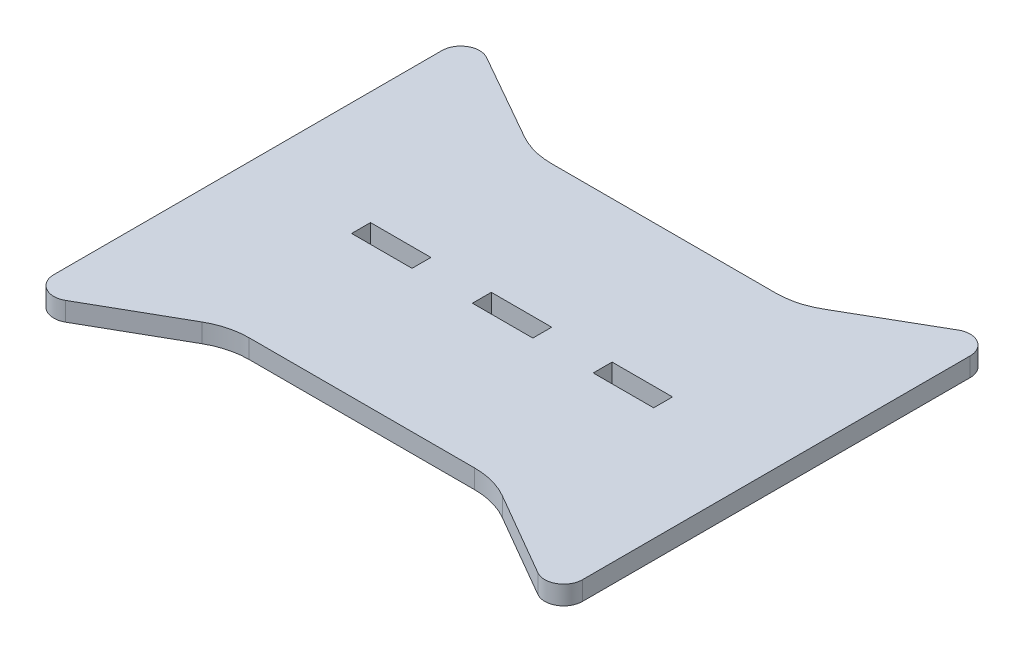
ISO-10303-21;
HEADER;
FILE_DESCRIPTION(('STEP AP214'),'2;1');
FILE_NAME('part.step','',(''),(''),'','','');
FILE_SCHEMA(('AUTOMOTIVE_DESIGN { 1 0 10303 214 1 1 1 1 }'));
ENDSEC;
DATA;
#1=APPLICATION_CONTEXT('core data for automotive mechanical design processes');
#2=APPLICATION_PROTOCOL_DEFINITION('international standard','automotive_design',2000,#1);
#3=PRODUCT_CONTEXT('',#1,'mechanical');
#4=PRODUCT('Part','Part','',(#3));
#5=PRODUCT_RELATED_PRODUCT_CATEGORY('part','',(#4));
#6=PRODUCT_DEFINITION_FORMATION('','',#4);
#7=PRODUCT_DEFINITION_CONTEXT('part definition',#1,'design');
#8=PRODUCT_DEFINITION('design','',#6,#7);
#9=PRODUCT_DEFINITION_SHAPE('','',#8);
#10=(LENGTH_UNIT() NAMED_UNIT(*) SI_UNIT(.MILLI.,.METRE.));
#11=(NAMED_UNIT(*) PLANE_ANGLE_UNIT() SI_UNIT($,.RADIAN.));
#12=(NAMED_UNIT(*) SI_UNIT($,.STERADIAN.) SOLID_ANGLE_UNIT());
#13=UNCERTAINTY_MEASURE_WITH_UNIT(LENGTH_MEASURE(1.E-05),#10,'distance_accuracy_value','');
#14=(GEOMETRIC_REPRESENTATION_CONTEXT(3) GLOBAL_UNCERTAINTY_ASSIGNED_CONTEXT((#13)) GLOBAL_UNIT_ASSIGNED_CONTEXT((#10,
#11,#12)) REPRESENTATION_CONTEXT('',''));
#15=CARTESIAN_POINT('',(0.,0.,0.));
#16=DIRECTION('',(0.,0.,1.));
#17=DIRECTION('',(1.,0.,0.));
#18=AXIS2_PLACEMENT_3D('',#15,#16,#17);
#19=CARTESIAN_POINT('',(-29.4953972452855,5.,-60.));
#20=DIRECTION('',(0.,-1.,0.));
#21=DIRECTION('',(0.,0.,-1.));
#22=AXIS2_PLACEMENT_3D('',#19,#20,#21);
#23=PLANE('',#22);
#24=DIRECTION('',(1.,0.,0.));
#25=VECTOR('',#24,1.);
#26=CARTESIAN_POINT('',(24.,5.,2.5));
#27=LINE('',#26,#25);
#28=CARTESIAN_POINT('',(24.,5.,2.5));
#29=VERTEX_POINT('',#28);
#30=CARTESIAN_POINT('',(40.,5.,2.5));
#31=VERTEX_POINT('',#30);
#32=EDGE_CURVE('E253',#29,#31,#27,.T.);
#33=ORIENTED_EDGE('',*,*,#32,.F.);
#34=DIRECTION('',(0.,0.,1.));
#35=VECTOR('',#34,1.);
#36=CARTESIAN_POINT('',(24.,5.,-2.50000000000013));
#37=LINE('',#36,#35);
#38=CARTESIAN_POINT('',(24.,5.,-2.50000000000013));
#39=VERTEX_POINT('',#38);
#40=EDGE_CURVE('E261',#39,#29,#37,.T.);
#41=ORIENTED_EDGE('',*,*,#40,.F.);
#42=DIRECTION('',(-1.,0.,0.));
#43=VECTOR('',#42,1.);
#44=CARTESIAN_POINT('',(24.,5.,-2.50000000000013));
#45=LINE('',#44,#43);
#46=CARTESIAN_POINT('',(40.,5.,-2.50000000000017));
#47=VERTEX_POINT('',#46);
#48=EDGE_CURVE('E258',#47,#39,#45,.T.);
#49=ORIENTED_EDGE('',*,*,#48,.F.);
#50=DIRECTION('',(0.,0.,-1.));
#51=VECTOR('',#50,1.);
#52=CARTESIAN_POINT('',(40.,5.,-2.50000000000017));
#53=LINE('',#52,#51);
#54=EDGE_CURVE('E255',#31,#47,#53,.T.);
#55=ORIENTED_EDGE('',*,*,#54,.F.);
#56=EDGE_LOOP('',(#33,#41,#49,#55));
#57=FACE_BOUND('',#56,.T.);
#58=CARTESIAN_POINT('',(-29.4953972452855,5.,-60.));
#59=DIRECTION('',(0.,-1.,0.));
#60=DIRECTION('',(0.,0.,-1.));
#61=AXIS2_PLACEMENT_3D('',#58,#59,#60);
#62=CIRCLE('',#61,20.);
#63=CARTESIAN_POINT('',(-29.4953972452854,5.,-40.));
#64=VERTEX_POINT('',#63);
#65=CARTESIAN_POINT('',(-39.3708181307167,5.,-42.6081610421557));
#66=VERTEX_POINT('',#65);
#67=EDGE_CURVE('E315',#64,#66,#62,.T.);
#68=ORIENTED_EDGE('',*,*,#67,.T.);
#69=DIRECTION('',(-0.869591947892215,0.,-0.493771044271557));
#70=VECTOR('',#69,1.);
#71=CARTESIAN_POINT('',(-62.5311447786422,5.,-55.7590402589375));
#72=LINE('',#71,#70);
#73=CARTESIAN_POINT('',(-62.5311447786422,5.,-55.7590402589375));
#74=VERTEX_POINT('',#73);
#75=EDGE_CURVE('E318',#66,#74,#72,.T.);
#76=ORIENTED_EDGE('',*,*,#75,.T.);
#77=CARTESIAN_POINT('',(-65.,5.,-51.4110805194765));
#78=DIRECTION('',(0.,1.,0.));
#79=DIRECTION('',(0.,0.,-1.));
#80=AXIS2_PLACEMENT_3D('',#77,#78,#79);
#81=CIRCLE('',#80,5.);
#82=CARTESIAN_POINT('',(-70.,5.,-51.4110805194764));
#83=VERTEX_POINT('',#82);
#84=EDGE_CURVE('E321',#74,#83,#81,.T.);
#85=ORIENTED_EDGE('',*,*,#84,.T.);
#86=DIRECTION('',(0.,0.,1.));
#87=VECTOR('',#86,1.);
#88=CARTESIAN_POINT('',(-70.,5.,-51.4110805194764));
#89=LINE('',#88,#87);
#90=CARTESIAN_POINT('',(-70.,5.,51.3934962218602));
#91=VERTEX_POINT('',#90);
#92=EDGE_CURVE('E323',#83,#91,#89,.T.);
#93=ORIENTED_EDGE('',*,*,#92,.T.);
#94=CARTESIAN_POINT('',(-65.,5.,51.3934962218603));
#95=DIRECTION('',(0.,1.,0.));
#96=DIRECTION('',(0.,0.,1.));
#97=AXIS2_PLACEMENT_3D('',#94,#95,#96);
#98=CIRCLE('',#97,5.);
#99=CARTESIAN_POINT('',(-62.5234196742123,5.,55.7370604138484));
#100=VERTEX_POINT('',#99);
#101=EDGE_CURVE('E325',#91,#100,#98,.T.);
#102=ORIENTED_EDGE('',*,*,#101,.T.);
#103=DIRECTION('',(0.868712838397626,0.,-0.495316065157531));
#104=VECTOR('',#103,1.);
#105=CARTESIAN_POINT('',(-62.5234196742123,5.,55.7370604138484));
#106=LINE('',#105,#104);
#107=CARTESIAN_POINT('',(-39.5280630416522,5.,42.6257432320475));
#108=VERTEX_POINT('',#107);
#109=EDGE_CURVE('E327',#100,#108,#106,.T.);
#110=ORIENTED_EDGE('',*,*,#109,.T.);
#111=CARTESIAN_POINT('',(-29.6217417385015,5.,60.));
#112=DIRECTION('',(0.,-1.,0.));
#113=DIRECTION('',(0.,0.,-1.));
#114=AXIS2_PLACEMENT_3D('',#111,#112,#113);
#115=CIRCLE('',#114,20.);
#116=CARTESIAN_POINT('',(-29.6217417385014,5.,40.));
#117=VERTEX_POINT('',#116);
#118=EDGE_CURVE('E329',#108,#117,#115,.T.);
#119=ORIENTED_EDGE('',*,*,#118,.T.);
#120=DIRECTION('',(1.,0.,0.));
#121=VECTOR('',#120,1.);
#122=CARTESIAN_POINT('',(-29.6217417385014,5.,40.));
#123=LINE('',#122,#121);
#124=CARTESIAN_POINT('',(30.0758989194273,5.,40.));
#125=VERTEX_POINT('',#124);
#126=EDGE_CURVE('E331',#117,#125,#123,.T.);
#127=ORIENTED_EDGE('',*,*,#126,.T.);
#128=CARTESIAN_POINT('',(30.0758989194273,5.,60.));
#129=DIRECTION('',(0.,-1.,0.));
#130=DIRECTION('',(0.,0.,-1.));
#131=AXIS2_PLACEMENT_3D('',#128,#129,#130);
#132=CIRCLE('',#131,20.);
#133=CARTESIAN_POINT('',(40.0949097217681,5.,42.6904817356872));
#134=VERTEX_POINT('',#133);
#135=EDGE_CURVE('E333',#125,#134,#132,.T.);
#136=ORIENTED_EDGE('',*,*,#135,.T.);
#137=DIRECTION('',(0.865475913215643,0.,0.500950540117036));
#138=VECTOR('',#137,1.);
#139=CARTESIAN_POINT('',(62.4952472994148,5.,55.65613570361));
#140=LINE('',#139,#138);
#141=CARTESIAN_POINT('',(62.4952472994148,5.,55.65613570361));
#142=VERTEX_POINT('',#141);
#143=EDGE_CURVE('E335',#134,#142,#140,.T.);
#144=ORIENTED_EDGE('',*,*,#143,.T.);
#145=CARTESIAN_POINT('',(65.,5.,51.3287561375318));
#146=DIRECTION('',(0.,1.,0.));
#147=DIRECTION('',(0.,0.,1.));
#148=AXIS2_PLACEMENT_3D('',#145,#146,#147);
#149=CIRCLE('',#148,5.);
#150=CARTESIAN_POINT('',(70.,5.,51.3287561375318));
#151=VERTEX_POINT('',#150);
#152=EDGE_CURVE('E337',#142,#151,#149,.T.);
#153=ORIENTED_EDGE('',*,*,#152,.T.);
#154=DIRECTION('',(0.,0.,-1.));
#155=VECTOR('',#154,1.);
#156=CARTESIAN_POINT('',(70.,5.,-51.3570346870093));
#157=LINE('',#156,#155);
#158=CARTESIAN_POINT('',(70.,5.,-51.3570346870093));
#159=VERTEX_POINT('',#158);
#160=EDGE_CURVE('E339',#151,#159,#157,.T.);
#161=ORIENTED_EDGE('',*,*,#160,.T.);
#162=CARTESIAN_POINT('',(65.,5.,-51.3570346870093));
#163=DIRECTION('',(0.,1.,0.));
#164=DIRECTION('',(0.,0.,-1.));
#165=AXIS2_PLACEMENT_3D('',#162,#163,#164);
#166=CIRCLE('',#165,5.);
#167=CARTESIAN_POINT('',(62.5075012048602,5.,-55.6914838741872));
#168=VERTEX_POINT('',#167);
#169=EDGE_CURVE('E341',#159,#168,#166,.T.);
#170=ORIENTED_EDGE('',*,*,#169,.T.);
#171=DIRECTION('',(-0.866889837435573,0.,0.498499759027951));
#172=VECTOR('',#171,1.);
#173=CARTESIAN_POINT('',(62.5075012048602,5.,-55.6914838741872));
#174=LINE('',#173,#172);
#175=CARTESIAN_POINT('',(39.8496147033468,5.,-42.6622032512885));
#176=VERTEX_POINT('',#175);
#177=EDGE_CURVE('E343',#168,#176,#174,.T.);
#178=ORIENTED_EDGE('',*,*,#177,.T.);
#179=CARTESIAN_POINT('',(29.8796195227878,5.,-60.));
#180=DIRECTION('',(0.,-1.,0.));
#181=DIRECTION('',(0.,0.,1.));
#182=AXIS2_PLACEMENT_3D('',#179,#180,#181);
#183=CIRCLE('',#182,20.);
#184=CARTESIAN_POINT('',(29.8796195227877,5.,-40.));
#185=VERTEX_POINT('',#184);
#186=EDGE_CURVE('E345',#176,#185,#183,.T.);
#187=ORIENTED_EDGE('',*,*,#186,.T.);
#188=DIRECTION('',(-1.,0.,0.));
#189=VECTOR('',#188,1.);
#190=CARTESIAN_POINT('',(-29.4953972452854,5.,-40.));
#191=LINE('',#190,#189);
#192=EDGE_CURVE('E347',#185,#64,#191,.T.);
#193=ORIENTED_EDGE('',*,*,#192,.T.);
#194=EDGE_LOOP('',(#68,#76,#85,#93,#102,#110,#119,#127,#136,#144,#153,#161,#170,#178,#187,#193));
#195=FACE_BOUND('',#194,.T.);
#196=DIRECTION('',(0.,0.,-1.));
#197=VECTOR('',#196,1.);
#198=CARTESIAN_POINT('',(-24.,5.,-2.5));
#199=LINE('',#198,#197);
#200=CARTESIAN_POINT('',(-24.,5.,2.5));
#201=VERTEX_POINT('',#200);
#202=CARTESIAN_POINT('',(-24.,5.,-2.5));
#203=VERTEX_POINT('',#202);
#204=EDGE_CURVE('E284',#201,#203,#199,.T.);
#205=ORIENTED_EDGE('',*,*,#204,.F.);
#206=DIRECTION('',(1.,0.,0.));
#207=VECTOR('',#206,1.);
#208=CARTESIAN_POINT('',(-40.,5.,2.5));
#209=LINE('',#208,#207);
#210=CARTESIAN_POINT('',(-40.,5.,2.5));
#211=VERTEX_POINT('',#210);
#212=EDGE_CURVE('E292',#211,#201,#209,.T.);
#213=ORIENTED_EDGE('',*,*,#212,.F.);
#214=DIRECTION('',(0.,0.,1.));
#215=VECTOR('',#214,1.);
#216=CARTESIAN_POINT('',(-40.,5.,-2.5));
#217=LINE('',#216,#215);
#218=CARTESIAN_POINT('',(-40.,5.,-2.5));
#219=VERTEX_POINT('',#218);
#220=EDGE_CURVE('E289',#219,#211,#217,.T.);
#221=ORIENTED_EDGE('',*,*,#220,.F.);
#222=DIRECTION('',(-1.,0.,0.));
#223=VECTOR('',#222,1.);
#224=CARTESIAN_POINT('',(-40.,5.,-2.5));
#225=LINE('',#224,#223);
#226=EDGE_CURVE('E286',#203,#219,#225,.T.);
#227=ORIENTED_EDGE('',*,*,#226,.F.);
#228=EDGE_LOOP('',(#205,#213,#221,#227));
#229=FACE_BOUND('',#228,.T.);
#230=DIRECTION('',(0.,0.,1.));
#231=VECTOR('',#230,1.);
#232=CARTESIAN_POINT('',(-7.99999999999997,5.,-2.5));
#233=LINE('',#232,#231);
#234=CARTESIAN_POINT('',(-7.99999999999997,5.,-2.5));
#235=VERTEX_POINT('',#234);
#236=CARTESIAN_POINT('',(-7.99999999999997,5.,2.5));
#237=VERTEX_POINT('',#236);
#238=EDGE_CURVE('E217',#235,#237,#233,.T.);
#239=ORIENTED_EDGE('',*,*,#238,.F.);
#240=DIRECTION('',(-1.,0.,0.));
#241=VECTOR('',#240,1.);
#242=CARTESIAN_POINT('',(-7.99999999999997,5.,-2.5));
#243=LINE('',#242,#241);
#244=CARTESIAN_POINT('',(8.00000000000002,5.,-2.50000000000003));
#245=VERTEX_POINT('',#244);
#246=EDGE_CURVE('E239',#245,#235,#243,.T.);
#247=ORIENTED_EDGE('',*,*,#246,.F.);
#248=DIRECTION('',(0.,0.,-1.));
#249=VECTOR('',#248,1.);
#250=CARTESIAN_POINT('',(8.00000000000002,5.,-2.50000000000003));
#251=LINE('',#250,#249);
#252=CARTESIAN_POINT('',(8.00000000000003,5.,2.5));
#253=VERTEX_POINT('',#252);
#254=EDGE_CURVE('E237',#253,#245,#251,.T.);
#255=ORIENTED_EDGE('',*,*,#254,.F.);
#256=DIRECTION('',(1.,0.,0.));
#257=VECTOR('',#256,1.);
#258=CARTESIAN_POINT('',(-7.99999999999997,5.,2.5));
#259=LINE('',#258,#257);
#260=EDGE_CURVE('E225',#237,#253,#259,.T.);
#261=ORIENTED_EDGE('',*,*,#260,.F.);
#262=EDGE_LOOP('',(#239,#247,#255,#261));
#263=FACE_BOUND('',#262,.T.);
#264=ADVANCED_FACE('F32',(#57,#195,#229,#263),#23,.F.);
#265=CARTESIAN_POINT('',(-29.4953972452855,0.,-60.));
#266=DIRECTION('',(0.,-1.,0.));
#267=DIRECTION('',(0.,0.,-1.));
#268=AXIS2_PLACEMENT_3D('',#265,#266,#267);
#269=PLANE('',#268);
#270=CARTESIAN_POINT('',(-29.4953972452855,0.,-60.));
#271=DIRECTION('',(0.,-1.,0.));
#272=DIRECTION('',(0.,0.,-1.));
#273=AXIS2_PLACEMENT_3D('',#270,#271,#272);
#274=CIRCLE('',#273,20.);
#275=CARTESIAN_POINT('',(-29.4953972452854,0.,-40.));
#276=VERTEX_POINT('',#275);
#277=CARTESIAN_POINT('',(-39.3708181307167,0.,-42.6081610421557));
#278=VERTEX_POINT('',#277);
#279=EDGE_CURVE('E314',#276,#278,#274,.T.);
#280=ORIENTED_EDGE('',*,*,#279,.F.);
#281=DIRECTION('',(-1.,0.,0.));
#282=VECTOR('',#281,1.);
#283=CARTESIAN_POINT('',(-29.4953972452854,0.,-40.));
#284=LINE('',#283,#282);
#285=CARTESIAN_POINT('',(29.8796195227877,0.,-40.));
#286=VERTEX_POINT('',#285);
#287=EDGE_CURVE('E319',#286,#276,#284,.T.);
#288=ORIENTED_EDGE('',*,*,#287,.F.);
#289=CARTESIAN_POINT('',(29.8796195227878,0.,-60.));
#290=DIRECTION('',(0.,-1.,0.));
#291=DIRECTION('',(0.,0.,1.));
#292=AXIS2_PLACEMENT_3D('',#289,#290,#291);
#293=CIRCLE('',#292,20.);
#294=CARTESIAN_POINT('',(39.8496147033468,0.,-42.6622032512885));
#295=VERTEX_POINT('',#294);
#296=EDGE_CURVE('E378',#295,#286,#293,.T.);
#297=ORIENTED_EDGE('',*,*,#296,.F.);
#298=DIRECTION('',(-0.866889837435573,0.,0.498499759027951));
#299=VECTOR('',#298,1.);
#300=CARTESIAN_POINT('',(62.5075012048602,0.,-55.6914838741872));
#301=LINE('',#300,#299);
#302=CARTESIAN_POINT('',(62.5075012048602,0.,-55.6914838741872));
#303=VERTEX_POINT('',#302);
#304=EDGE_CURVE('E376',#303,#295,#301,.T.);
#305=ORIENTED_EDGE('',*,*,#304,.F.);
#306=CARTESIAN_POINT('',(65.,0.,-51.3570346870093));
#307=DIRECTION('',(0.,1.,0.));
#308=DIRECTION('',(0.,0.,-1.));
#309=AXIS2_PLACEMENT_3D('',#306,#307,#308);
#310=CIRCLE('',#309,5.);
#311=CARTESIAN_POINT('',(70.,0.,-51.3570346870093));
#312=VERTEX_POINT('',#311);
#313=EDGE_CURVE('E374',#312,#303,#310,.T.);
#314=ORIENTED_EDGE('',*,*,#313,.F.);
#315=DIRECTION('',(0.,0.,-1.));
#316=VECTOR('',#315,1.);
#317=CARTESIAN_POINT('',(70.,0.,-51.3570346870093));
#318=LINE('',#317,#316);
#319=CARTESIAN_POINT('',(70.,0.,51.3287561375318));
#320=VERTEX_POINT('',#319);
#321=EDGE_CURVE('E372',#320,#312,#318,.T.);
#322=ORIENTED_EDGE('',*,*,#321,.F.);
#323=CARTESIAN_POINT('',(65.,0.,51.3287561375318));
#324=DIRECTION('',(0.,1.,0.));
#325=DIRECTION('',(0.,0.,1.));
#326=AXIS2_PLACEMENT_3D('',#323,#324,#325);
#327=CIRCLE('',#326,5.);
#328=CARTESIAN_POINT('',(62.4952472994148,0.,55.65613570361));
#329=VERTEX_POINT('',#328);
#330=EDGE_CURVE('E370',#329,#320,#327,.T.);
#331=ORIENTED_EDGE('',*,*,#330,.F.);
#332=DIRECTION('',(0.865475913215643,0.,0.500950540117036));
#333=VECTOR('',#332,1.);
#334=CARTESIAN_POINT('',(62.4952472994148,0.,55.65613570361));
#335=LINE('',#334,#333);
#336=CARTESIAN_POINT('',(40.0949097217681,0.,42.6904817356872));
#337=VERTEX_POINT('',#336);
#338=EDGE_CURVE('E368',#337,#329,#335,.T.);
#339=ORIENTED_EDGE('',*,*,#338,.F.);
#340=CARTESIAN_POINT('',(30.0758989194273,0.,60.));
#341=DIRECTION('',(0.,-1.,0.));
#342=DIRECTION('',(0.,0.,-1.));
#343=AXIS2_PLACEMENT_3D('',#340,#341,#342);
#344=CIRCLE('',#343,20.);
#345=CARTESIAN_POINT('',(30.0758989194273,0.,40.));
#346=VERTEX_POINT('',#345);
#347=EDGE_CURVE('E366',#346,#337,#344,.T.);
#348=ORIENTED_EDGE('',*,*,#347,.F.);
#349=DIRECTION('',(1.,0.,0.));
#350=VECTOR('',#349,1.);
#351=CARTESIAN_POINT('',(-29.6217417385014,0.,40.));
#352=LINE('',#351,#350);
#353=CARTESIAN_POINT('',(-29.6217417385014,0.,40.));
#354=VERTEX_POINT('',#353);
#355=EDGE_CURVE('E364',#354,#346,#352,.T.);
#356=ORIENTED_EDGE('',*,*,#355,.F.);
#357=CARTESIAN_POINT('',(-29.6217417385015,0.,60.));
#358=DIRECTION('',(0.,-1.,0.));
#359=DIRECTION('',(0.,0.,-1.));
#360=AXIS2_PLACEMENT_3D('',#357,#358,#359);
#361=CIRCLE('',#360,20.);
#362=CARTESIAN_POINT('',(-39.5280630416522,0.,42.6257432320475));
#363=VERTEX_POINT('',#362);
#364=EDGE_CURVE('E362',#363,#354,#361,.T.);
#365=ORIENTED_EDGE('',*,*,#364,.F.);
#366=DIRECTION('',(0.868712838397626,0.,-0.495316065157531));
#367=VECTOR('',#366,1.);
#368=CARTESIAN_POINT('',(-62.5234196742123,0.,55.7370604138484));
#369=LINE('',#368,#367);
#370=CARTESIAN_POINT('',(-62.5234196742123,0.,55.7370604138484));
#371=VERTEX_POINT('',#370);
#372=EDGE_CURVE('E360',#371,#363,#369,.T.);
#373=ORIENTED_EDGE('',*,*,#372,.F.);
#374=CARTESIAN_POINT('',(-65.,0.,51.3934962218603));
#375=DIRECTION('',(0.,1.,0.));
#376=DIRECTION('',(0.,0.,1.));
#377=AXIS2_PLACEMENT_3D('',#374,#375,#376);
#378=CIRCLE('',#377,5.);
#379=CARTESIAN_POINT('',(-70.,0.,51.3934962218602));
#380=VERTEX_POINT('',#379);
#381=EDGE_CURVE('E358',#380,#371,#378,.T.);
#382=ORIENTED_EDGE('',*,*,#381,.F.);
#383=DIRECTION('',(0.,0.,1.));
#384=VECTOR('',#383,1.);
#385=CARTESIAN_POINT('',(-70.,0.,-51.4110805194764));
#386=LINE('',#385,#384);
#387=CARTESIAN_POINT('',(-70.,0.,-51.4110805194764));
#388=VERTEX_POINT('',#387);
#389=EDGE_CURVE('E356',#388,#380,#386,.T.);
#390=ORIENTED_EDGE('',*,*,#389,.F.);
#391=CARTESIAN_POINT('',(-65.,0.,-51.4110805194765));
#392=DIRECTION('',(0.,1.,0.));
#393=DIRECTION('',(0.,0.,-1.));
#394=AXIS2_PLACEMENT_3D('',#391,#392,#393);
#395=CIRCLE('',#394,5.);
#396=CARTESIAN_POINT('',(-62.5311447786422,0.,-55.7590402589375));
#397=VERTEX_POINT('',#396);
#398=EDGE_CURVE('E354',#397,#388,#395,.T.);
#399=ORIENTED_EDGE('',*,*,#398,.F.);
#400=DIRECTION('',(-0.869591947892215,0.,-0.493771044271557));
#401=VECTOR('',#400,1.);
#402=CARTESIAN_POINT('',(-62.5311447786422,0.,-55.7590402589375));
#403=LINE('',#402,#401);
#404=EDGE_CURVE('E352',#278,#397,#403,.T.);
#405=ORIENTED_EDGE('',*,*,#404,.F.);
#406=EDGE_LOOP('',(#280,#288,#297,#305,#314,#322,#331,#339,#348,#356,#365,#373,#382,#390,#399,#405));
#407=FACE_BOUND('',#406,.T.);
#408=DIRECTION('',(1.,0.,0.));
#409=VECTOR('',#408,1.);
#410=CARTESIAN_POINT('',(-40.,0.,2.5));
#411=LINE('',#410,#409);
#412=CARTESIAN_POINT('',(-40.,0.,2.5));
#413=VERTEX_POINT('',#412);
#414=CARTESIAN_POINT('',(-24.,0.,2.5));
#415=VERTEX_POINT('',#414);
#416=EDGE_CURVE('E287',#413,#415,#411,.T.);
#417=ORIENTED_EDGE('',*,*,#416,.T.);
#418=DIRECTION('',(0.,0.,-1.));
#419=VECTOR('',#418,1.);
#420=CARTESIAN_POINT('',(-24.,0.,-2.5));
#421=LINE('',#420,#419);
#422=CARTESIAN_POINT('',(-24.,0.,-2.5));
#423=VERTEX_POINT('',#422);
#424=EDGE_CURVE('E283',#415,#423,#421,.T.);
#425=ORIENTED_EDGE('',*,*,#424,.T.);
#426=DIRECTION('',(-1.,0.,0.));
#427=VECTOR('',#426,1.);
#428=CARTESIAN_POINT('',(-40.,0.,-2.5));
#429=LINE('',#428,#427);
#430=CARTESIAN_POINT('',(-40.,0.,-2.5));
#431=VERTEX_POINT('',#430);
#432=EDGE_CURVE('E297',#423,#431,#429,.T.);
#433=ORIENTED_EDGE('',*,*,#432,.T.);
#434=DIRECTION('',(0.,0.,1.));
#435=VECTOR('',#434,1.);
#436=CARTESIAN_POINT('',(-40.,0.,-2.5));
#437=LINE('',#436,#435);
#438=EDGE_CURVE('E300',#431,#413,#437,.T.);
#439=ORIENTED_EDGE('',*,*,#438,.T.);
#440=EDGE_LOOP('',(#417,#425,#433,#439));
#441=FACE_BOUND('',#440,.T.);
#442=DIRECTION('',(0.,0.,1.));
#443=VECTOR('',#442,1.);
#444=CARTESIAN_POINT('',(24.,0.,-2.50000000000013));
#445=LINE('',#444,#443);
#446=CARTESIAN_POINT('',(24.,0.,-2.50000000000013));
#447=VERTEX_POINT('',#446);
#448=CARTESIAN_POINT('',(24.,0.,2.50000000000001));
#449=VERTEX_POINT('',#448);
#450=EDGE_CURVE('E256',#447,#449,#445,.T.);
#451=ORIENTED_EDGE('',*,*,#450,.T.);
#452=DIRECTION('',(1.,0.,0.));
#453=VECTOR('',#452,1.);
#454=CARTESIAN_POINT('',(24.,0.,2.5));
#455=LINE('',#454,#453);
#456=CARTESIAN_POINT('',(40.,0.,2.5));
#457=VERTEX_POINT('',#456);
#458=EDGE_CURVE('E233',#449,#457,#455,.T.);
#459=ORIENTED_EDGE('',*,*,#458,.T.);
#460=DIRECTION('',(0.,0.,-1.));
#461=VECTOR('',#460,1.);
#462=CARTESIAN_POINT('',(40.,0.,-2.50000000000017));
#463=LINE('',#462,#461);
#464=CARTESIAN_POINT('',(40.,0.,-2.50000000000017));
#465=VERTEX_POINT('',#464);
#466=EDGE_CURVE('E266',#457,#465,#463,.T.);
#467=ORIENTED_EDGE('',*,*,#466,.T.);
#468=DIRECTION('',(-1.,0.,0.));
#469=VECTOR('',#468,1.);
#470=CARTESIAN_POINT('',(24.,0.,-2.50000000000013));
#471=LINE('',#470,#469);
#472=EDGE_CURVE('E269',#465,#447,#471,.T.);
#473=ORIENTED_EDGE('',*,*,#472,.T.);
#474=EDGE_LOOP('',(#451,#459,#467,#473));
#475=FACE_BOUND('',#474,.T.);
#476=DIRECTION('',(-1.,0.,0.));
#477=VECTOR('',#476,1.);
#478=CARTESIAN_POINT('',(-7.99999999999997,0.,-2.5));
#479=LINE('',#478,#477);
#480=CARTESIAN_POINT('',(8.00000000000002,0.,-2.50000000000003));
#481=VERTEX_POINT('',#480);
#482=CARTESIAN_POINT('',(-7.99999999999997,0.,-2.5));
#483=VERTEX_POINT('',#482);
#484=EDGE_CURVE('E226',#481,#483,#479,.T.);
#485=ORIENTED_EDGE('',*,*,#484,.T.);
#486=DIRECTION('',(0.,0.,1.));
#487=VECTOR('',#486,1.);
#488=CARTESIAN_POINT('',(-7.99999999999997,0.,-2.5));
#489=LINE('',#488,#487);
#490=CARTESIAN_POINT('',(-7.99999999999997,0.,2.5));
#491=VERTEX_POINT('',#490);
#492=EDGE_CURVE('E55',#483,#491,#489,.T.);
#493=ORIENTED_EDGE('',*,*,#492,.T.);
#494=DIRECTION('',(1.,0.,0.));
#495=VECTOR('',#494,1.);
#496=CARTESIAN_POINT('',(-7.99999999999997,0.,2.5));
#497=LINE('',#496,#495);
#498=CARTESIAN_POINT('',(8.00000000000003,0.,2.5));
#499=VERTEX_POINT('',#498);
#500=EDGE_CURVE('E232',#491,#499,#497,.T.);
#501=ORIENTED_EDGE('',*,*,#500,.T.);
#502=DIRECTION('',(0.,0.,-1.));
#503=VECTOR('',#502,1.);
#504=CARTESIAN_POINT('',(8.00000000000002,0.,-2.50000000000003));
#505=LINE('',#504,#503);
#506=EDGE_CURVE('E245',#499,#481,#505,.T.);
#507=ORIENTED_EDGE('',*,*,#506,.T.);
#508=EDGE_LOOP('',(#485,#493,#501,#507));
#509=FACE_BOUND('',#508,.T.);
#510=ADVANCED_FACE('F432',(#407,#441,#475,#509),#269,.T.);
#511=CARTESIAN_POINT('',(-29.4953972452855,5.,-60.));
#512=DIRECTION('',(0.,-1.,0.));
#513=DIRECTION('',(0.,0.,-1.));
#514=AXIS2_PLACEMENT_3D('',#511,#512,#513);
#515=CYLINDRICAL_SURFACE('',#514,20.);
#516=ORIENTED_EDGE('',*,*,#279,.T.);
#517=DIRECTION('',(0.,-1.,0.));
#518=VECTOR('',#517,1.);
#519=CARTESIAN_POINT('',(-39.3708181307167,5.,-42.6081610421557));
#520=LINE('',#519,#518);
#521=EDGE_CURVE('E11',#66,#278,#520,.T.);
#522=ORIENTED_EDGE('',*,*,#521,.F.);
#523=ORIENTED_EDGE('',*,*,#67,.F.);
#524=DIRECTION('',(0.,-1.,0.));
#525=VECTOR('',#524,1.);
#526=CARTESIAN_POINT('',(-29.4953972452854,5.,-40.));
#527=LINE('',#526,#525);
#528=EDGE_CURVE('E349',#64,#276,#527,.T.);
#529=ORIENTED_EDGE('',*,*,#528,.T.);
#530=EDGE_LOOP('',(#516,#522,#523,#529));
#531=FACE_BOUND('',#530,.T.);
#532=ADVANCED_FACE('F34',(#531),#515,.F.);
#533=CARTESIAN_POINT('',(-62.5311447786422,5.,-55.7590402589375));
#534=DIRECTION('',(-0.493771044271557,0.,0.869591947892215));
#535=DIRECTION('',(0.869591947892215,0.,0.493771044271557));
#536=AXIS2_PLACEMENT_3D('',#533,#534,#535);
#537=PLANE('',#536);
#538=ORIENTED_EDGE('',*,*,#404,.T.);
#539=DIRECTION('',(0.,-1.,0.));
#540=VECTOR('',#539,1.);
#541=CARTESIAN_POINT('',(-62.5311447786422,5.,-55.7590402589375));
#542=LINE('',#541,#540);
#543=EDGE_CURVE('E40',#74,#397,#542,.T.);
#544=ORIENTED_EDGE('',*,*,#543,.F.);
#545=ORIENTED_EDGE('',*,*,#75,.F.);
#546=ORIENTED_EDGE('',*,*,#521,.T.);
#547=EDGE_LOOP('',(#538,#544,#545,#546));
#548=FACE_BOUND('',#547,.T.);
#549=ADVANCED_FACE('F450',(#548),#537,.F.);
#550=CARTESIAN_POINT('',(-65.,5.,-51.4110805194765));
#551=DIRECTION('',(0.,-1.,0.));
#552=DIRECTION('',(0.,0.,-1.));
#553=AXIS2_PLACEMENT_3D('',#550,#551,#552);
#554=CYLINDRICAL_SURFACE('',#553,5.);
#555=ORIENTED_EDGE('',*,*,#398,.T.);
#556=DIRECTION('',(0.,-1.,0.));
#557=VECTOR('',#556,1.);
#558=CARTESIAN_POINT('',(-70.,5.,-51.4110805194764));
#559=LINE('',#558,#557);
#560=EDGE_CURVE('E419',#83,#388,#559,.T.);
#561=ORIENTED_EDGE('',*,*,#560,.F.);
#562=ORIENTED_EDGE('',*,*,#84,.F.);
#563=ORIENTED_EDGE('',*,*,#543,.T.);
#564=EDGE_LOOP('',(#555,#561,#562,#563));
#565=FACE_BOUND('',#564,.T.);
#566=ADVANCED_FACE('F426',(#565),#554,.T.);
#567=CARTESIAN_POINT('',(-70.,5.,-51.4110805194764));
#568=DIRECTION('',(1.,0.,0.));
#569=DIRECTION('',(0.,0.,-1.));
#570=AXIS2_PLACEMENT_3D('',#567,#568,#569);
#571=PLANE('',#570);
#572=ORIENTED_EDGE('',*,*,#389,.T.);
#573=DIRECTION('',(0.,-1.,0.));
#574=VECTOR('',#573,1.);
#575=CARTESIAN_POINT('',(-70.,5.,51.3934962218602));
#576=LINE('',#575,#574);
#577=EDGE_CURVE('E416',#91,#380,#576,.T.);
#578=ORIENTED_EDGE('',*,*,#577,.F.);
#579=ORIENTED_EDGE('',*,*,#92,.F.);
#580=ORIENTED_EDGE('',*,*,#560,.T.);
#581=EDGE_LOOP('',(#572,#578,#579,#580));
#582=FACE_BOUND('',#581,.T.);
#583=ADVANCED_FACE('F438',(#582),#571,.F.);
#584=CARTESIAN_POINT('',(-65.,5.,51.3934962218603));
#585=DIRECTION('',(0.,-1.,0.));
#586=DIRECTION('',(0.,0.,-1.));
#587=AXIS2_PLACEMENT_3D('',#584,#585,#586);
#588=CYLINDRICAL_SURFACE('',#587,5.);
#589=ORIENTED_EDGE('',*,*,#381,.T.);
#590=DIRECTION('',(0.,-1.,0.));
#591=VECTOR('',#590,1.);
#592=CARTESIAN_POINT('',(-62.5234196742123,5.,55.7370604138484));
#593=LINE('',#592,#591);
#594=EDGE_CURVE('E413',#100,#371,#593,.T.);
#595=ORIENTED_EDGE('',*,*,#594,.F.);
#596=ORIENTED_EDGE('',*,*,#101,.F.);
#597=ORIENTED_EDGE('',*,*,#577,.T.);
#598=EDGE_LOOP('',(#589,#595,#596,#597));
#599=FACE_BOUND('',#598,.T.);
#600=ADVANCED_FACE('F442',(#599),#588,.T.);
#601=CARTESIAN_POINT('',(-62.5234196742123,5.,55.7370604138484));
#602=DIRECTION('',(-0.495316065157531,0.,-0.868712838397626));
#603=DIRECTION('',(-0.868712838397626,0.,0.495316065157531));
#604=AXIS2_PLACEMENT_3D('',#601,#602,#603);
#605=PLANE('',#604);
#606=ORIENTED_EDGE('',*,*,#372,.T.);
#607=DIRECTION('',(0.,-1.,0.));
#608=VECTOR('',#607,1.);
#609=CARTESIAN_POINT('',(-39.5280630416522,5.,42.6257432320475));
#610=LINE('',#609,#608);
#611=EDGE_CURVE('E410',#108,#363,#610,.T.);
#612=ORIENTED_EDGE('',*,*,#611,.F.);
#613=ORIENTED_EDGE('',*,*,#109,.F.);
#614=ORIENTED_EDGE('',*,*,#594,.T.);
#615=EDGE_LOOP('',(#606,#612,#613,#614));
#616=FACE_BOUND('',#615,.T.);
#617=ADVANCED_FACE('F503',(#616),#605,.F.);
#618=CARTESIAN_POINT('',(-29.6217417385015,5.,60.));
#619=DIRECTION('',(0.,-1.,0.));
#620=DIRECTION('',(0.,0.,-1.));
#621=AXIS2_PLACEMENT_3D('',#618,#619,#620);
#622=CYLINDRICAL_SURFACE('',#621,20.);
#623=ORIENTED_EDGE('',*,*,#364,.T.);
#624=DIRECTION('',(0.,-1.,0.));
#625=VECTOR('',#624,1.);
#626=CARTESIAN_POINT('',(-29.6217417385014,5.,40.));
#627=LINE('',#626,#625);
#628=EDGE_CURVE('E407',#117,#354,#627,.T.);
#629=ORIENTED_EDGE('',*,*,#628,.F.);
#630=ORIENTED_EDGE('',*,*,#118,.F.);
#631=ORIENTED_EDGE('',*,*,#611,.T.);
#632=EDGE_LOOP('',(#623,#629,#630,#631));
#633=FACE_BOUND('',#632,.T.);
#634=ADVANCED_FACE('F500',(#633),#622,.F.);
#635=CARTESIAN_POINT('',(-29.6217417385014,5.,40.));
#636=DIRECTION('',(0.,0.,-1.));
#637=DIRECTION('',(-1.,0.,0.));
#638=AXIS2_PLACEMENT_3D('',#635,#636,#637);
#639=PLANE('',#638);
#640=ORIENTED_EDGE('',*,*,#355,.T.);
#641=DIRECTION('',(0.,-1.,0.));
#642=VECTOR('',#641,1.);
#643=CARTESIAN_POINT('',(30.0758989194273,5.,40.));
#644=LINE('',#643,#642);
#645=EDGE_CURVE('E404',#125,#346,#644,.T.);
#646=ORIENTED_EDGE('',*,*,#645,.F.);
#647=ORIENTED_EDGE('',*,*,#126,.F.);
#648=ORIENTED_EDGE('',*,*,#628,.T.);
#649=EDGE_LOOP('',(#640,#646,#647,#648));
#650=FACE_BOUND('',#649,.T.);
#651=ADVANCED_FACE('F496',(#650),#639,.F.);
#652=CARTESIAN_POINT('',(30.0758989194273,5.,60.));
#653=DIRECTION('',(0.,-1.,0.));
#654=DIRECTION('',(0.,0.,-1.));
#655=AXIS2_PLACEMENT_3D('',#652,#653,#654);
#656=CYLINDRICAL_SURFACE('',#655,20.);
#657=ORIENTED_EDGE('',*,*,#347,.T.);
#658=DIRECTION('',(0.,-1.,0.));
#659=VECTOR('',#658,1.);
#660=CARTESIAN_POINT('',(40.0949097217681,5.,42.6904817356872));
#661=LINE('',#660,#659);
#662=EDGE_CURVE('E401',#134,#337,#661,.T.);
#663=ORIENTED_EDGE('',*,*,#662,.F.);
#664=ORIENTED_EDGE('',*,*,#135,.F.);
#665=ORIENTED_EDGE('',*,*,#645,.T.);
#666=EDGE_LOOP('',(#657,#663,#664,#665));
#667=FACE_BOUND('',#666,.T.);
#668=ADVANCED_FACE('F492',(#667),#656,.F.);
#669=CARTESIAN_POINT('',(62.4952472994148,5.,55.65613570361));
#670=DIRECTION('',(0.500950540117036,0.,-0.865475913215643));
#671=DIRECTION('',(-0.865475913215643,0.,-0.500950540117036));
#672=AXIS2_PLACEMENT_3D('',#669,#670,#671);
#673=PLANE('',#672);
#674=ORIENTED_EDGE('',*,*,#338,.T.);
#675=DIRECTION('',(0.,-1.,0.));
#676=VECTOR('',#675,1.);
#677=CARTESIAN_POINT('',(62.4952472994148,5.,55.65613570361));
#678=LINE('',#677,#676);
#679=EDGE_CURVE('E398',#142,#329,#678,.T.);
#680=ORIENTED_EDGE('',*,*,#679,.F.);
#681=ORIENTED_EDGE('',*,*,#143,.F.);
#682=ORIENTED_EDGE('',*,*,#662,.T.);
#683=EDGE_LOOP('',(#674,#680,#681,#682));
#684=FACE_BOUND('',#683,.T.);
#685=ADVANCED_FACE('F487',(#684),#673,.F.);
#686=CARTESIAN_POINT('',(65.,5.,51.3287561375318));
#687=DIRECTION('',(0.,-1.,0.));
#688=DIRECTION('',(0.,0.,-1.));
#689=AXIS2_PLACEMENT_3D('',#686,#687,#688);
#690=CYLINDRICAL_SURFACE('',#689,5.);
#691=ORIENTED_EDGE('',*,*,#330,.T.);
#692=DIRECTION('',(0.,-1.,0.));
#693=VECTOR('',#692,1.);
#694=CARTESIAN_POINT('',(70.,5.,51.3287561375318));
#695=LINE('',#694,#693);
#696=EDGE_CURVE('E395',#151,#320,#695,.T.);
#697=ORIENTED_EDGE('',*,*,#696,.F.);
#698=ORIENTED_EDGE('',*,*,#152,.F.);
#699=ORIENTED_EDGE('',*,*,#679,.T.);
#700=EDGE_LOOP('',(#691,#697,#698,#699));
#701=FACE_BOUND('',#700,.T.);
#702=ADVANCED_FACE('F481',(#701),#690,.T.);
#703=CARTESIAN_POINT('',(70.,5.,-51.3570346870093));
#704=DIRECTION('',(-1.,0.,0.));
#705=DIRECTION('',(0.,0.,1.));
#706=AXIS2_PLACEMENT_3D('',#703,#704,#705);
#707=PLANE('',#706);
#708=ORIENTED_EDGE('',*,*,#321,.T.);
#709=DIRECTION('',(0.,-1.,0.));
#710=VECTOR('',#709,1.);
#711=CARTESIAN_POINT('',(70.,5.,-51.3570346870093));
#712=LINE('',#711,#710);
#713=EDGE_CURVE('E392',#159,#312,#712,.T.);
#714=ORIENTED_EDGE('',*,*,#713,.F.);
#715=ORIENTED_EDGE('',*,*,#160,.F.);
#716=ORIENTED_EDGE('',*,*,#696,.T.);
#717=EDGE_LOOP('',(#708,#714,#715,#716));
#718=FACE_BOUND('',#717,.T.);
#719=ADVANCED_FACE('F477',(#718),#707,.F.);
#720=CARTESIAN_POINT('',(65.,5.,-51.3570346870093));
#721=DIRECTION('',(0.,-1.,0.));
#722=DIRECTION('',(0.,0.,-1.));
#723=AXIS2_PLACEMENT_3D('',#720,#721,#722);
#724=CYLINDRICAL_SURFACE('',#723,5.);
#725=ORIENTED_EDGE('',*,*,#313,.T.);
#726=DIRECTION('',(0.,-1.,0.));
#727=VECTOR('',#726,1.);
#728=CARTESIAN_POINT('',(62.5075012048602,5.,-55.6914838741872));
#729=LINE('',#728,#727);
#730=EDGE_CURVE('E389',#168,#303,#729,.T.);
#731=ORIENTED_EDGE('',*,*,#730,.F.);
#732=ORIENTED_EDGE('',*,*,#169,.F.);
#733=ORIENTED_EDGE('',*,*,#713,.T.);
#734=EDGE_LOOP('',(#725,#731,#732,#733));
#735=FACE_BOUND('',#734,.T.);
#736=ADVANCED_FACE('F472',(#735),#724,.T.);
#737=CARTESIAN_POINT('',(62.5075012048602,5.,-55.6914838741872));
#738=DIRECTION('',(0.498499759027951,0.,0.866889837435573));
#739=DIRECTION('',(0.866889837435573,0.,-0.498499759027951));
#740=AXIS2_PLACEMENT_3D('',#737,#738,#739);
#741=PLANE('',#740);
#742=ORIENTED_EDGE('',*,*,#304,.T.);
#743=DIRECTION('',(0.,-1.,0.));
#744=VECTOR('',#743,1.);
#745=CARTESIAN_POINT('',(39.8496147033468,5.,-42.6622032512885));
#746=LINE('',#745,#744);
#747=EDGE_CURVE('E386',#176,#295,#746,.T.);
#748=ORIENTED_EDGE('',*,*,#747,.F.);
#749=ORIENTED_EDGE('',*,*,#177,.F.);
#750=ORIENTED_EDGE('',*,*,#730,.T.);
#751=EDGE_LOOP('',(#742,#748,#749,#750));
#752=FACE_BOUND('',#751,.T.);
#753=ADVANCED_FACE('F466',(#752),#741,.F.);
#754=CARTESIAN_POINT('',(29.8796195227878,5.,-60.));
#755=DIRECTION('',(0.,-1.,0.));
#756=DIRECTION('',(0.,0.,-1.));
#757=AXIS2_PLACEMENT_3D('',#754,#755,#756);
#758=CYLINDRICAL_SURFACE('',#757,20.);
#759=ORIENTED_EDGE('',*,*,#296,.T.);
#760=DIRECTION('',(0.,-1.,0.));
#761=VECTOR('',#760,1.);
#762=CARTESIAN_POINT('',(29.8796195227877,5.,-40.));
#763=LINE('',#762,#761);
#764=EDGE_CURVE('E383',#185,#286,#763,.T.);
#765=ORIENTED_EDGE('',*,*,#764,.F.);
#766=ORIENTED_EDGE('',*,*,#186,.F.);
#767=ORIENTED_EDGE('',*,*,#747,.T.);
#768=EDGE_LOOP('',(#759,#765,#766,#767));
#769=FACE_BOUND('',#768,.T.);
#770=ADVANCED_FACE('F462',(#769),#758,.F.);
#771=CARTESIAN_POINT('',(-29.4953972452854,5.,-40.));
#772=DIRECTION('',(0.,0.,1.));
#773=DIRECTION('',(1.,0.,0.));
#774=AXIS2_PLACEMENT_3D('',#771,#772,#773);
#775=PLANE('',#774);
#776=ORIENTED_EDGE('',*,*,#287,.T.);
#777=ORIENTED_EDGE('',*,*,#528,.F.);
#778=ORIENTED_EDGE('',*,*,#192,.F.);
#779=ORIENTED_EDGE('',*,*,#764,.T.);
#780=EDGE_LOOP('',(#776,#777,#778,#779));
#781=FACE_BOUND('',#780,.T.);
#782=ADVANCED_FACE('F457',(#781),#775,.F.);
#783=CARTESIAN_POINT('',(-24.,5.,-2.5));
#784=DIRECTION('',(-1.,0.,0.));
#785=DIRECTION('',(0.,0.,1.));
#786=AXIS2_PLACEMENT_3D('',#783,#784,#785);
#787=PLANE('',#786);
#788=ORIENTED_EDGE('',*,*,#424,.F.);
#789=DIRECTION('',(0.,-1.,0.));
#790=VECTOR('',#789,1.);
#791=CARTESIAN_POINT('',(-24.,5.,2.5));
#792=LINE('',#791,#790);
#793=EDGE_CURVE('E294',#201,#415,#792,.T.);
#794=ORIENTED_EDGE('',*,*,#793,.F.);
#795=ORIENTED_EDGE('',*,*,#204,.T.);
#796=DIRECTION('',(0.,-1.,0.));
#797=VECTOR('',#796,1.);
#798=CARTESIAN_POINT('',(-24.,5.,-2.5));
#799=LINE('',#798,#797);
#800=EDGE_CURVE('E311',#203,#423,#799,.T.);
#801=ORIENTED_EDGE('',*,*,#800,.T.);
#802=EDGE_LOOP('',(#788,#794,#795,#801));
#803=FACE_BOUND('',#802,.T.);
#804=ADVANCED_FACE('F521',(#803),#787,.T.);
#805=CARTESIAN_POINT('',(-40.,5.,-2.5));
#806=DIRECTION('',(0.,0.,1.));
#807=DIRECTION('',(1.,0.,0.));
#808=AXIS2_PLACEMENT_3D('',#805,#806,#807);
#809=PLANE('',#808);
#810=ORIENTED_EDGE('',*,*,#432,.F.);
#811=ORIENTED_EDGE('',*,*,#800,.F.);
#812=ORIENTED_EDGE('',*,*,#226,.T.);
#813=DIRECTION('',(0.,-1.,0.));
#814=VECTOR('',#813,1.);
#815=CARTESIAN_POINT('',(-40.,5.,-2.5));
#816=LINE('',#815,#814);
#817=EDGE_CURVE('E309',#219,#431,#816,.T.);
#818=ORIENTED_EDGE('',*,*,#817,.T.);
#819=EDGE_LOOP('',(#810,#811,#812,#818));
#820=FACE_BOUND('',#819,.T.);
#821=ADVANCED_FACE('F583',(#820),#809,.T.);
#822=CARTESIAN_POINT('',(-40.,5.,-2.5));
#823=DIRECTION('',(1.,0.,0.));
#824=DIRECTION('',(0.,0.,-1.));
#825=AXIS2_PLACEMENT_3D('',#822,#823,#824);
#826=PLANE('',#825);
#827=ORIENTED_EDGE('',*,*,#438,.F.);
#828=ORIENTED_EDGE('',*,*,#817,.F.);
#829=ORIENTED_EDGE('',*,*,#220,.T.);
#830=DIRECTION('',(0.,-1.,0.));
#831=VECTOR('',#830,1.);
#832=CARTESIAN_POINT('',(-40.,5.,2.5));
#833=LINE('',#832,#831);
#834=EDGE_CURVE('E307',#211,#413,#833,.T.);
#835=ORIENTED_EDGE('',*,*,#834,.T.);
#836=EDGE_LOOP('',(#827,#828,#829,#835));
#837=FACE_BOUND('',#836,.T.);
#838=ADVANCED_FACE('F590',(#837),#826,.T.);
#839=CARTESIAN_POINT('',(-40.,5.,2.5));
#840=DIRECTION('',(0.,0.,-1.));
#841=DIRECTION('',(-1.,0.,0.));
#842=AXIS2_PLACEMENT_3D('',#839,#840,#841);
#843=PLANE('',#842);
#844=ORIENTED_EDGE('',*,*,#416,.F.);
#845=ORIENTED_EDGE('',*,*,#834,.F.);
#846=ORIENTED_EDGE('',*,*,#212,.T.);
#847=ORIENTED_EDGE('',*,*,#793,.T.);
#848=EDGE_LOOP('',(#844,#845,#846,#847));
#849=FACE_BOUND('',#848,.T.);
#850=ADVANCED_FACE('F597',(#849),#843,.T.);
#851=CARTESIAN_POINT('',(24.,5.,2.5));
#852=DIRECTION('',(0.,0.,-1.));
#853=DIRECTION('',(-1.,0.,0.));
#854=AXIS2_PLACEMENT_3D('',#851,#852,#853);
#855=PLANE('',#854);
#856=ORIENTED_EDGE('',*,*,#458,.F.);
#857=DIRECTION('',(0.,-1.,0.));
#858=VECTOR('',#857,1.);
#859=CARTESIAN_POINT('',(24.,5.,2.5));
#860=LINE('',#859,#858);
#861=EDGE_CURVE('E263',#29,#449,#860,.T.);
#862=ORIENTED_EDGE('',*,*,#861,.F.);
#863=ORIENTED_EDGE('',*,*,#32,.T.);
#864=DIRECTION('',(0.,-1.,0.));
#865=VECTOR('',#864,1.);
#866=CARTESIAN_POINT('',(40.,5.,2.5));
#867=LINE('',#866,#865);
#868=EDGE_CURVE('E280',#31,#457,#867,.T.);
#869=ORIENTED_EDGE('',*,*,#868,.T.);
#870=EDGE_LOOP('',(#856,#862,#863,#869));
#871=FACE_BOUND('',#870,.T.);
#872=ADVANCED_FACE('F605',(#871),#855,.T.);
#873=CARTESIAN_POINT('',(40.,5.,-2.50000000000017));
#874=DIRECTION('',(-1.,0.,0.));
#875=DIRECTION('',(0.,0.,1.));
#876=AXIS2_PLACEMENT_3D('',#873,#874,#875);
#877=PLANE('',#876);
#878=ORIENTED_EDGE('',*,*,#466,.F.);
#879=ORIENTED_EDGE('',*,*,#868,.F.);
#880=ORIENTED_EDGE('',*,*,#54,.T.);
#881=DIRECTION('',(0.,-1.,0.));
#882=VECTOR('',#881,1.);
#883=CARTESIAN_POINT('',(40.,5.,-2.50000000000017));
#884=LINE('',#883,#882);
#885=EDGE_CURVE('E278',#47,#465,#884,.T.);
#886=ORIENTED_EDGE('',*,*,#885,.T.);
#887=EDGE_LOOP('',(#878,#879,#880,#886));
#888=FACE_BOUND('',#887,.T.);
#889=ADVANCED_FACE('F613',(#888),#877,.T.);
#890=CARTESIAN_POINT('',(24.,5.,-2.50000000000013));
#891=DIRECTION('',(0.,0.,1.));
#892=DIRECTION('',(1.,0.,0.));
#893=AXIS2_PLACEMENT_3D('',#890,#891,#892);
#894=PLANE('',#893);
#895=ORIENTED_EDGE('',*,*,#472,.F.);
#896=ORIENTED_EDGE('',*,*,#885,.F.);
#897=ORIENTED_EDGE('',*,*,#48,.T.);
#898=DIRECTION('',(0.,-1.,0.));
#899=VECTOR('',#898,1.);
#900=CARTESIAN_POINT('',(24.,5.,-2.50000000000013));
#901=LINE('',#900,#899);
#902=EDGE_CURVE('E276',#39,#447,#901,.T.);
#903=ORIENTED_EDGE('',*,*,#902,.T.);
#904=EDGE_LOOP('',(#895,#896,#897,#903));
#905=FACE_BOUND('',#904,.T.);
#906=ADVANCED_FACE('F621',(#905),#894,.T.);
#907=CARTESIAN_POINT('',(24.,5.,-2.50000000000013));
#908=DIRECTION('',(1.,0.,0.));
#909=DIRECTION('',(0.,0.,-1.));
#910=AXIS2_PLACEMENT_3D('',#907,#908,#909);
#911=PLANE('',#910);
#912=ORIENTED_EDGE('',*,*,#450,.F.);
#913=ORIENTED_EDGE('',*,*,#902,.F.);
#914=ORIENTED_EDGE('',*,*,#40,.T.);
#915=ORIENTED_EDGE('',*,*,#861,.T.);
#916=EDGE_LOOP('',(#912,#913,#914,#915));
#917=FACE_BOUND('',#916,.T.);
#918=ADVANCED_FACE('F629',(#917),#911,.T.);
#919=CARTESIAN_POINT('',(-7.99999999999997,5.,-2.5));
#920=DIRECTION('',(1.,0.,0.));
#921=DIRECTION('',(0.,0.,-1.));
#922=AXIS2_PLACEMENT_3D('',#919,#920,#921);
#923=PLANE('',#922);
#924=ORIENTED_EDGE('',*,*,#492,.F.);
#925=DIRECTION('',(0.,-1.,0.));
#926=VECTOR('',#925,1.);
#927=CARTESIAN_POINT('',(-7.99999999999997,5.,-2.5));
#928=LINE('',#927,#926);
#929=EDGE_CURVE('E221',#235,#483,#928,.T.);
#930=ORIENTED_EDGE('',*,*,#929,.F.);
#931=ORIENTED_EDGE('',*,*,#238,.T.);
#932=DIRECTION('',(0.,-1.,0.));
#933=VECTOR('',#932,1.);
#934=CARTESIAN_POINT('',(-7.99999999999997,5.,2.5));
#935=LINE('',#934,#933);
#936=EDGE_CURVE('E220',#237,#491,#935,.T.);
#937=ORIENTED_EDGE('',*,*,#936,.T.);
#938=EDGE_LOOP('',(#924,#930,#931,#937));
#939=FACE_BOUND('',#938,.T.);
#940=ADVANCED_FACE('F219',(#939),#923,.T.);
#941=CARTESIAN_POINT('',(-7.99999999999997,5.,2.5));
#942=DIRECTION('',(0.,0.,-1.));
#943=DIRECTION('',(-1.,0.,0.));
#944=AXIS2_PLACEMENT_3D('',#941,#942,#943);
#945=PLANE('',#944);
#946=ORIENTED_EDGE('',*,*,#500,.F.);
#947=ORIENTED_EDGE('',*,*,#936,.F.);
#948=ORIENTED_EDGE('',*,*,#260,.T.);
#949=DIRECTION('',(0.,-1.,0.));
#950=VECTOR('',#949,1.);
#951=CARTESIAN_POINT('',(8.00000000000003,5.,2.5));
#952=LINE('',#951,#950);
#953=EDGE_CURVE('E234',#253,#499,#952,.T.);
#954=ORIENTED_EDGE('',*,*,#953,.T.);
#955=EDGE_LOOP('',(#946,#947,#948,#954));
#956=FACE_BOUND('',#955,.T.);
#957=ADVANCED_FACE('F229',(#956),#945,.T.);
#958=CARTESIAN_POINT('',(8.00000000000002,5.,-2.50000000000003));
#959=DIRECTION('',(-1.,0.,0.));
#960=DIRECTION('',(0.,0.,1.));
#961=AXIS2_PLACEMENT_3D('',#958,#959,#960);
#962=PLANE('',#961);
#963=ORIENTED_EDGE('',*,*,#506,.F.);
#964=ORIENTED_EDGE('',*,*,#953,.F.);
#965=ORIENTED_EDGE('',*,*,#254,.T.);
#966=DIRECTION('',(0.,-1.,0.));
#967=VECTOR('',#966,1.);
#968=CARTESIAN_POINT('',(8.00000000000002,5.,-2.50000000000003));
#969=LINE('',#968,#967);
#970=EDGE_CURVE('E47',#245,#481,#969,.T.);
#971=ORIENTED_EDGE('',*,*,#970,.T.);
#972=EDGE_LOOP('',(#963,#964,#965,#971));
#973=FACE_BOUND('',#972,.T.);
#974=ADVANCED_FACE('F650',(#973),#962,.T.);
#975=CARTESIAN_POINT('',(-7.99999999999997,5.,-2.5));
#976=DIRECTION('',(0.,0.,1.));
#977=DIRECTION('',(1.,0.,0.));
#978=AXIS2_PLACEMENT_3D('',#975,#976,#977);
#979=PLANE('',#978);
#980=ORIENTED_EDGE('',*,*,#484,.F.);
#981=ORIENTED_EDGE('',*,*,#970,.F.);
#982=ORIENTED_EDGE('',*,*,#246,.T.);
#983=ORIENTED_EDGE('',*,*,#929,.T.);
#984=EDGE_LOOP('',(#980,#981,#982,#983));
#985=FACE_BOUND('',#984,.T.);
#986=ADVANCED_FACE('F657',(#985),#979,.T.);
#987=CLOSED_SHELL('',(#264,#510,#532,#549,#566,#583,#600,#617,#634,#651,#668,#685,#702,#719,
#736,#753,#770,#782,#804,#821,#838,#850,#872,#889,#906,#918,#940,#957,#974,#986));
#988=MANIFOLD_SOLID_BREP('B2',#987);
#989=ADVANCED_BREP_SHAPE_REPRESENTATION('',(#18,#988),#14);
#990=SHAPE_DEFINITION_REPRESENTATION(#9,#989);
ENDSEC;
END-ISO-10303-21;
